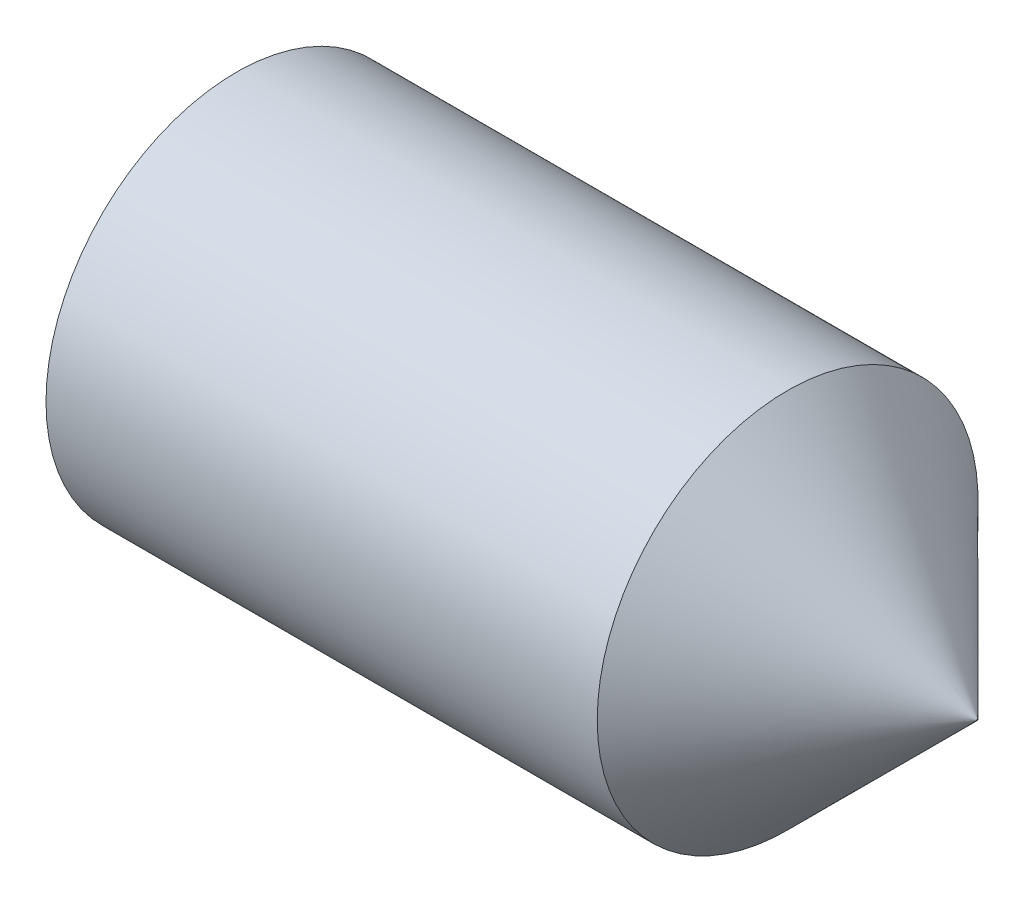
ISO-10303-21;
HEADER;
FILE_DESCRIPTION(('STEP AP214'),'2;1');
FILE_NAME('part.step','',(''),(''),'','','');
FILE_SCHEMA(('AUTOMOTIVE_DESIGN { 1 0 10303 214 1 1 1 1 }'));
ENDSEC;
DATA;
#1=APPLICATION_CONTEXT('core data for automotive mechanical design processes');
#2=APPLICATION_PROTOCOL_DEFINITION('international standard','automotive_design',2000,#1);
#3=PRODUCT_CONTEXT('',#1,'mechanical');
#4=PRODUCT('Part','Part','',(#3));
#5=PRODUCT_RELATED_PRODUCT_CATEGORY('part','',(#4));
#6=PRODUCT_DEFINITION_FORMATION('','',#4);
#7=PRODUCT_DEFINITION_CONTEXT('part definition',#1,'design');
#8=PRODUCT_DEFINITION('design','',#6,#7);
#9=PRODUCT_DEFINITION_SHAPE('','',#8);
#10=(LENGTH_UNIT() NAMED_UNIT(*) SI_UNIT(.MILLI.,.METRE.));
#11=(NAMED_UNIT(*) PLANE_ANGLE_UNIT() SI_UNIT($,.RADIAN.));
#12=(NAMED_UNIT(*) SI_UNIT($,.STERADIAN.) SOLID_ANGLE_UNIT());
#13=UNCERTAINTY_MEASURE_WITH_UNIT(LENGTH_MEASURE(1.E-05),#10,'distance_accuracy_value','');
#14=(GEOMETRIC_REPRESENTATION_CONTEXT(3) GLOBAL_UNCERTAINTY_ASSIGNED_CONTEXT((#13)) GLOBAL_UNIT_ASSIGNED_CONTEXT((#10,
#11,#12)) REPRESENTATION_CONTEXT('',''));
#15=CARTESIAN_POINT('',(0.,0.,0.));
#16=DIRECTION('',(0.,0.,1.));
#17=DIRECTION('',(1.,0.,0.));
#18=AXIS2_PLACEMENT_3D('',#15,#16,#17);
#19=CARTESIAN_POINT('',(0.,0.,0.));
#20=DIRECTION('',(-1.,0.,0.));
#21=DIRECTION('',(0.,0.,1.));
#22=AXIS2_PLACEMENT_3D('',#19,#20,#21);
#23=PLANE('',#22);
#24=CARTESIAN_POINT('',(0.,0.,0.));
#25=DIRECTION('',(-1.,0.,0.));
#26=DIRECTION('',(0.,0.,1.));
#27=AXIS2_PLACEMENT_3D('',#24,#25,#26);
#28=CIRCLE('',#27,1.2195);
#29=CARTESIAN_POINT('',(0.,0.,1.2195));
#30=VERTEX_POINT('',#29);
#31=EDGE_CURVE('E11',#30,#30,#28,.T.);
#32=ORIENTED_EDGE('',*,*,#31,.T.);
#33=EDGE_LOOP('',(#32));
#34=FACE_BOUND('',#33,.T.);
#35=DIRECTION('',(0.,0.,-1.));
#36=VECTOR('',#35,1.);
#37=CARTESIAN_POINT('',(0.,0.750000000000003,0.433012701892216));
#38=LINE('',#37,#36);
#39=CARTESIAN_POINT('',(0.,0.750000000000003,0.433012701892216));
#40=VERTEX_POINT('',#39);
#41=CARTESIAN_POINT('',(0.,0.750000000000003,-0.433012701892222));
#42=VERTEX_POINT('',#41);
#43=EDGE_CURVE('E127',#40,#42,#38,.T.);
#44=ORIENTED_EDGE('',*,*,#43,.F.);
#45=DIRECTION('',(0.,-0.866025403784439,0.5));
#46=VECTOR('',#45,1.);
#47=CARTESIAN_POINT('',(0.,0.750000000000003,0.433012701892216));
#48=LINE('',#47,#46);
#49=CARTESIAN_POINT('',(0.,0.,0.866025403784435));
#50=VERTEX_POINT('',#49);
#51=EDGE_CURVE('E49',#40,#50,#48,.T.);
#52=ORIENTED_EDGE('',*,*,#51,.T.);
#53=DIRECTION('',(0.,0.866025403784439,0.5));
#54=VECTOR('',#53,1.);
#55=CARTESIAN_POINT('',(0.,-0.749999999999996,0.433012701892216));
#56=LINE('',#55,#54);
#57=CARTESIAN_POINT('',(0.,-0.749999999999996,0.433012701892216));
#58=VERTEX_POINT('',#57);
#59=EDGE_CURVE('E118',#58,#50,#56,.T.);
#60=ORIENTED_EDGE('',*,*,#59,.F.);
#61=DIRECTION('',(0.,0.,-1.));
#62=VECTOR('',#61,1.);
#63=CARTESIAN_POINT('',(0.,-0.749999999999996,0.433012701892216));
#64=LINE('',#63,#62);
#65=CARTESIAN_POINT('',(0.,-0.749999999999996,-0.433012701892222));
#66=VERTEX_POINT('',#65);
#67=EDGE_CURVE('E121',#58,#66,#64,.T.);
#68=ORIENTED_EDGE('',*,*,#67,.T.);
#69=DIRECTION('',(0.,0.866025403784438,-0.500000000000001));
#70=VECTOR('',#69,1.);
#71=CARTESIAN_POINT('',(0.,-0.749999999999996,-0.433012701892222));
#72=LINE('',#71,#70);
#73=CARTESIAN_POINT('',(0.,0.,-0.866025403784441));
#74=VERTEX_POINT('',#73);
#75=EDGE_CURVE('E124',#66,#74,#72,.T.);
#76=ORIENTED_EDGE('',*,*,#75,.T.);
#77=DIRECTION('',(0.,-0.866025403784439,-0.5));
#78=VECTOR('',#77,1.);
#79=CARTESIAN_POINT('',(0.,0.750000000000003,-0.433012701892222));
#80=LINE('',#79,#78);
#81=EDGE_CURVE('E107',#42,#74,#80,.T.);
#82=ORIENTED_EDGE('',*,*,#81,.F.);
#83=EDGE_LOOP('',(#44,#52,#60,#68,#76,#82));
#84=FACE_BOUND('',#83,.T.);
#85=ADVANCED_FACE('F35',(#34,#84),#23,.T.);
#86=CARTESIAN_POINT('',(0.,0.,0.));
#87=DIRECTION('',(1.,0.,0.));
#88=DIRECTION('',(0.,0.,-1.));
#89=AXIS2_PLACEMENT_3D('',#86,#87,#88);
#90=CONICAL_SURFACE('',#89,1.2195,1.0471975511966);
#91=CARTESIAN_POINT('',(0.161946750507689,0.,0.));
#92=DIRECTION('',(-1.,0.,0.));
#93=DIRECTION('',(0.,0.,1.));
#94=AXIS2_PLACEMENT_3D('',#91,#92,#93);
#95=CIRCLE('',#94,1.5);
#96=CARTESIAN_POINT('',(0.161946750507689,0.,1.5));
#97=VERTEX_POINT('',#96);
#98=EDGE_CURVE('E42',#97,#97,#95,.T.);
#99=ORIENTED_EDGE('',*,*,#98,.T.);
#100=EDGE_LOOP('',(#99));
#101=FACE_BOUND('',#100,.T.);
#102=ORIENTED_EDGE('',*,*,#31,.F.);
#103=EDGE_LOOP('',(#102));
#104=FACE_BOUND('',#103,.T.);
#105=ADVANCED_FACE('F144',(#101,#104),#90,.T.);
#106=CARTESIAN_POINT('',(-12.7,0.,0.));
#107=DIRECTION('',(-1.,0.,0.));
#108=DIRECTION('',(0.,0.,1.));
#109=AXIS2_PLACEMENT_3D('',#106,#107,#108);
#110=CYLINDRICAL_SURFACE('',#109,1.5);
#111=CARTESIAN_POINT('',(4.50500000000001,0.,0.));
#112=DIRECTION('',(-1.,0.,0.));
#113=DIRECTION('',(0.,0.,1.));
#114=AXIS2_PLACEMENT_3D('',#111,#112,#113);
#115=CIRCLE('',#114,1.5);
#116=CARTESIAN_POINT('',(4.50500000000001,0.,1.5));
#117=VERTEX_POINT('',#116);
#118=EDGE_CURVE('E139',#117,#117,#115,.T.);
#119=ORIENTED_EDGE('',*,*,#118,.T.);
#120=EDGE_LOOP('',(#119));
#121=FACE_BOUND('',#120,.T.);
#122=ORIENTED_EDGE('',*,*,#98,.F.);
#123=EDGE_LOOP('',(#122));
#124=FACE_BOUND('',#123,.T.);
#125=ADVANCED_FACE('F147',(#121,#124),#110,.T.);
#126=CARTESIAN_POINT('',(6.,0.,0.));
#127=DIRECTION('',(-1.,0.,0.));
#128=DIRECTION('',(0.,0.,1.));
#129=AXIS2_PLACEMENT_3D('',#126,#127,#128);
#130=CONICAL_SURFACE('',#129,0.005,0.785398163397451);
#131=ORIENTED_EDGE('',*,*,#118,.F.);
#132=EDGE_LOOP('',(#131));
#133=FACE_BOUND('',#132,.T.);
#134=CARTESIAN_POINT('',(6.,0.,0.));
#135=DIRECTION('',(-1.,0.,0.));
#136=DIRECTION('',(0.,0.,1.));
#137=AXIS2_PLACEMENT_3D('',#134,#135,#136);
#138=CIRCLE('',#137,0.005);
#139=CARTESIAN_POINT('',(6.,0.,0.005));
#140=VERTEX_POINT('',#139);
#141=EDGE_CURVE('E136',#140,#140,#138,.T.);
#142=ORIENTED_EDGE('',*,*,#141,.T.);
#143=EDGE_LOOP('',(#142));
#144=FACE_BOUND('',#143,.T.);
#145=ADVANCED_FACE('F149',(#133,#144),#130,.T.);
#146=CARTESIAN_POINT('',(6.,0.,0.));
#147=DIRECTION('',(-1.,0.,0.));
#148=DIRECTION('',(0.,0.,1.));
#149=AXIS2_PLACEMENT_3D('',#146,#147,#148);
#150=PLANE('',#149);
#151=ORIENTED_EDGE('',*,*,#141,.F.);
#152=EDGE_LOOP('',(#151));
#153=FACE_BOUND('',#152,.T.);
#154=ADVANCED_FACE('F156',(#153),#150,.F.);
#155=CARTESIAN_POINT('',(2.1,0.750000000000003,0.433012701892216));
#156=DIRECTION('',(0.,-0.5,-0.866025403784438));
#157=DIRECTION('',(0.,0.866025403784439,-0.5));
#158=AXIS2_PLACEMENT_3D('',#155,#156,#157);
#159=PLANE('',#158);
#160=ORIENTED_EDGE('',*,*,#51,.F.);
#161=DIRECTION('',(-1.,0.,0.));
#162=VECTOR('',#161,1.);
#163=CARTESIAN_POINT('',(2.1,0.750000000000003,0.433012701892216));
#164=LINE('',#163,#162);
#165=CARTESIAN_POINT('',(2.1,0.750000000000003,0.433012701892216));
#166=VERTEX_POINT('',#165);
#167=EDGE_CURVE('E54',#166,#40,#164,.T.);
#168=ORIENTED_EDGE('',*,*,#167,.F.);
#169=DIRECTION('',(0.,-0.866025403784439,0.5));
#170=VECTOR('',#169,1.);
#171=CARTESIAN_POINT('',(2.1,0.750000000000003,0.433012701892216));
#172=LINE('',#171,#170);
#173=CARTESIAN_POINT('',(2.1,0.,0.866025403784435));
#174=VERTEX_POINT('',#173);
#175=EDGE_CURVE('E81',#166,#174,#172,.T.);
#176=ORIENTED_EDGE('',*,*,#175,.T.);
#177=DIRECTION('',(-1.,0.,0.));
#178=VECTOR('',#177,1.);
#179=CARTESIAN_POINT('',(2.1,0.,0.866025403784435));
#180=LINE('',#179,#178);
#181=EDGE_CURVE('E134',#174,#50,#180,.T.);
#182=ORIENTED_EDGE('',*,*,#181,.T.);
#183=EDGE_LOOP('',(#160,#168,#176,#182));
#184=FACE_BOUND('',#183,.T.);
#185=ADVANCED_FACE('F187',(#184),#159,.T.);
#186=CARTESIAN_POINT('',(2.1,-0.749999999999996,0.433012701892216));
#187=DIRECTION('',(0.,-0.5,0.866025403784439));
#188=DIRECTION('',(0.,-0.866025403784439,-0.5));
#189=AXIS2_PLACEMENT_3D('',#186,#187,#188);
#190=PLANE('',#189);
#191=ORIENTED_EDGE('',*,*,#59,.T.);
#192=ORIENTED_EDGE('',*,*,#181,.F.);
#193=DIRECTION('',(0.,0.866025403784439,0.5));
#194=VECTOR('',#193,1.);
#195=CARTESIAN_POINT('',(2.1,-0.749999999999996,0.433012701892216));
#196=LINE('',#195,#194);
#197=CARTESIAN_POINT('',(2.1,-0.749999999999996,0.433012701892216));
#198=VERTEX_POINT('',#197);
#199=EDGE_CURVE('E266',#198,#174,#196,.T.);
#200=ORIENTED_EDGE('',*,*,#199,.F.);
#201=DIRECTION('',(-1.,0.,0.));
#202=VECTOR('',#201,1.);
#203=CARTESIAN_POINT('',(2.1,-0.749999999999996,0.433012701892216));
#204=LINE('',#203,#202);
#205=EDGE_CURVE('E132',#198,#58,#204,.T.);
#206=ORIENTED_EDGE('',*,*,#205,.T.);
#207=EDGE_LOOP('',(#191,#192,#200,#206));
#208=FACE_BOUND('',#207,.T.);
#209=ADVANCED_FACE('F183',(#208),#190,.F.);
#210=CARTESIAN_POINT('',(2.1,-0.749999999999996,0.433012701892216));
#211=DIRECTION('',(0.,1.,0.));
#212=DIRECTION('',(0.,0.,1.));
#213=AXIS2_PLACEMENT_3D('',#210,#211,#212);
#214=PLANE('',#213);
#215=ORIENTED_EDGE('',*,*,#67,.F.);
#216=ORIENTED_EDGE('',*,*,#205,.F.);
#217=DIRECTION('',(0.,0.,-1.));
#218=VECTOR('',#217,1.);
#219=CARTESIAN_POINT('',(2.1,-0.749999999999996,0.433012701892216));
#220=LINE('',#219,#218);
#221=CARTESIAN_POINT('',(2.1,-0.749999999999996,-0.433012701892222));
#222=VERTEX_POINT('',#221);
#223=EDGE_CURVE('E102',#198,#222,#220,.T.);
#224=ORIENTED_EDGE('',*,*,#223,.T.);
#225=DIRECTION('',(-1.,0.,0.));
#226=VECTOR('',#225,1.);
#227=CARTESIAN_POINT('',(2.1,-0.749999999999996,-0.433012701892222));
#228=LINE('',#227,#226);
#229=EDGE_CURVE('E97',#222,#66,#228,.T.);
#230=ORIENTED_EDGE('',*,*,#229,.T.);
#231=EDGE_LOOP('',(#215,#216,#224,#230));
#232=FACE_BOUND('',#231,.T.);
#233=ADVANCED_FACE('F180',(#232),#214,.T.);
#234=CARTESIAN_POINT('',(2.1,-0.749999999999996,-0.433012701892222));
#235=DIRECTION('',(0.,0.500000000000001,0.866025403784438));
#236=DIRECTION('',(0.,-0.866025403784438,0.500000000000001));
#237=AXIS2_PLACEMENT_3D('',#234,#235,#236);
#238=PLANE('',#237);
#239=ORIENTED_EDGE('',*,*,#75,.F.);
#240=ORIENTED_EDGE('',*,*,#229,.F.);
#241=DIRECTION('',(0.,0.866025403784438,-0.500000000000001));
#242=VECTOR('',#241,1.);
#243=CARTESIAN_POINT('',(2.1,-0.749999999999996,-0.433012701892222));
#244=LINE('',#243,#242);
#245=CARTESIAN_POINT('',(2.1,0.,-0.866025403784441));
#246=VERTEX_POINT('',#245);
#247=EDGE_CURVE('E92',#222,#246,#244,.T.);
#248=ORIENTED_EDGE('',*,*,#247,.T.);
#249=DIRECTION('',(-1.,0.,0.));
#250=VECTOR('',#249,1.);
#251=CARTESIAN_POINT('',(2.1,0.,-0.866025403784441));
#252=LINE('',#251,#250);
#253=EDGE_CURVE('E96',#246,#74,#252,.T.);
#254=ORIENTED_EDGE('',*,*,#253,.T.);
#255=EDGE_LOOP('',(#239,#240,#248,#254));
#256=FACE_BOUND('',#255,.T.);
#257=ADVANCED_FACE('F95',(#256),#238,.T.);
#258=CARTESIAN_POINT('',(2.1,0.750000000000003,-0.433012701892222));
#259=DIRECTION('',(0.,0.5,-0.866025403784439));
#260=DIRECTION('',(0.,0.866025403784439,0.5));
#261=AXIS2_PLACEMENT_3D('',#258,#259,#260);
#262=PLANE('',#261);
#263=ORIENTED_EDGE('',*,*,#81,.T.);
#264=ORIENTED_EDGE('',*,*,#253,.F.);
#265=DIRECTION('',(0.,-0.866025403784439,-0.5));
#266=VECTOR('',#265,1.);
#267=CARTESIAN_POINT('',(2.1,0.750000000000003,-0.433012701892222));
#268=LINE('',#267,#266);
#269=CARTESIAN_POINT('',(2.1,0.750000000000003,-0.433012701892222));
#270=VERTEX_POINT('',#269);
#271=EDGE_CURVE('E101',#270,#246,#268,.T.);
#272=ORIENTED_EDGE('',*,*,#271,.F.);
#273=DIRECTION('',(-1.,0.,0.));
#274=VECTOR('',#273,1.);
#275=CARTESIAN_POINT('',(2.1,0.750000000000003,-0.433012701892222));
#276=LINE('',#275,#274);
#277=EDGE_CURVE('E77',#270,#42,#276,.T.);
#278=ORIENTED_EDGE('',*,*,#277,.T.);
#279=EDGE_LOOP('',(#263,#264,#272,#278));
#280=FACE_BOUND('',#279,.T.);
#281=ADVANCED_FACE('F104',(#280),#262,.F.);
#282=CARTESIAN_POINT('',(2.1,0.750000000000003,0.433012701892216));
#283=DIRECTION('',(0.,1.,0.));
#284=DIRECTION('',(0.,0.,1.));
#285=AXIS2_PLACEMENT_3D('',#282,#283,#284);
#286=PLANE('',#285);
#287=ORIENTED_EDGE('',*,*,#43,.T.);
#288=ORIENTED_EDGE('',*,*,#277,.F.);
#289=DIRECTION('',(0.,0.,-1.));
#290=VECTOR('',#289,1.);
#291=CARTESIAN_POINT('',(2.1,0.750000000000003,0.433012701892216));
#292=LINE('',#291,#290);
#293=EDGE_CURVE('E112',#166,#270,#292,.T.);
#294=ORIENTED_EDGE('',*,*,#293,.F.);
#295=ORIENTED_EDGE('',*,*,#167,.T.);
#296=EDGE_LOOP('',(#287,#288,#294,#295));
#297=FACE_BOUND('',#296,.T.);
#298=ADVANCED_FACE('F168',(#297),#286,.F.);
#299=CARTESIAN_POINT('',(2.1,1.5,0.));
#300=DIRECTION('',(1.,0.,0.));
#301=DIRECTION('',(0.,0.,-1.));
#302=AXIS2_PLACEMENT_3D('',#299,#300,#301);
#303=PLANE('',#302);
#304=ORIENTED_EDGE('',*,*,#175,.F.);
#305=ORIENTED_EDGE('',*,*,#293,.T.);
#306=ORIENTED_EDGE('',*,*,#271,.T.);
#307=ORIENTED_EDGE('',*,*,#247,.F.);
#308=ORIENTED_EDGE('',*,*,#223,.F.);
#309=ORIENTED_EDGE('',*,*,#199,.T.);
#310=EDGE_LOOP('',(#304,#305,#306,#307,#308,#309));
#311=FACE_BOUND('',#310,.T.);
#312=ADVANCED_FACE('F110',(#311),#303,.F.);
#313=CLOSED_SHELL('',(#85,#105,#125,#145,#154,#185,#209,#233,#257,#281,#298,#312));
#314=MANIFOLD_SOLID_BREP('B2',#313);
#315=ADVANCED_BREP_SHAPE_REPRESENTATION('',(#18,#314),#14);
#316=SHAPE_DEFINITION_REPRESENTATION(#9,#315);
ENDSEC;
END-ISO-10303-21;
